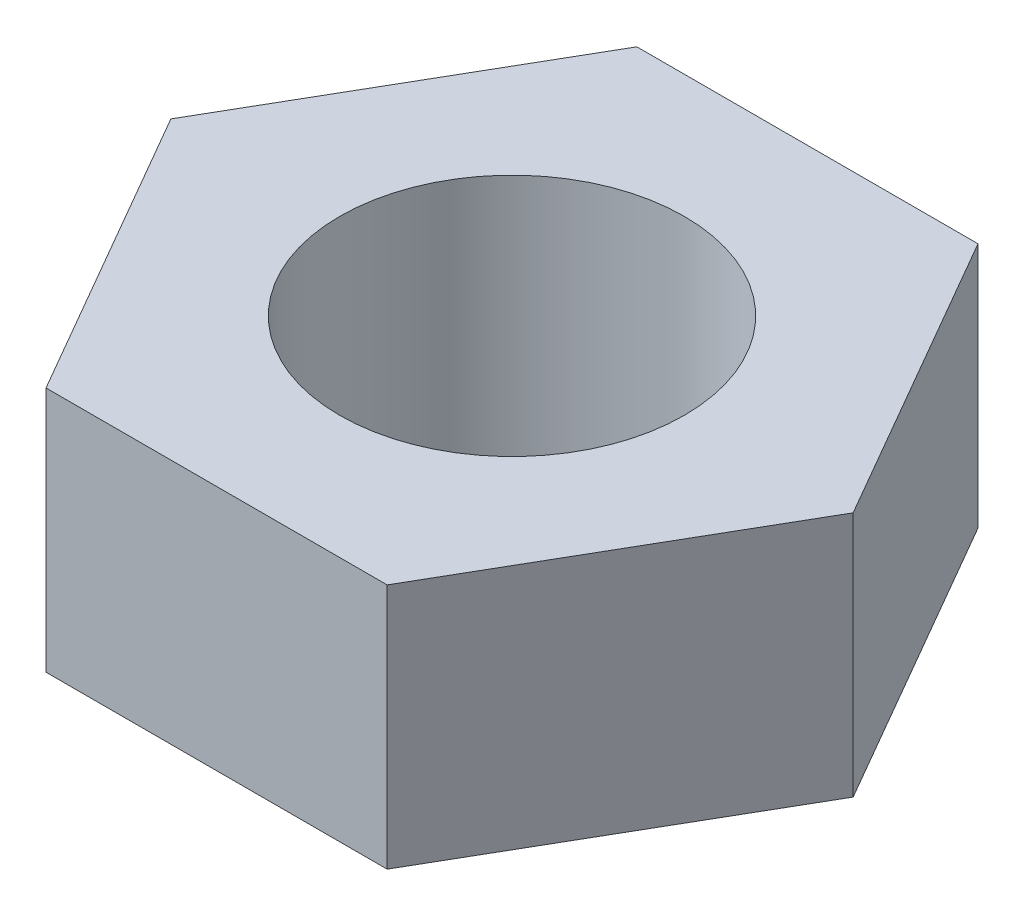
ISO-10303-21;
HEADER;
FILE_DESCRIPTION(('STEP AP214'),'2;1');
FILE_NAME('part.step','',(''),(''),'','','');
FILE_SCHEMA(('AUTOMOTIVE_DESIGN { 1 0 10303 214 1 1 1 1 }'));
ENDSEC;
DATA;
#1=APPLICATION_CONTEXT('core data for automotive mechanical design processes');
#2=APPLICATION_PROTOCOL_DEFINITION('international standard','automotive_design',2000,#1);
#3=PRODUCT_CONTEXT('',#1,'mechanical');
#4=PRODUCT('Part','Part','',(#3));
#5=PRODUCT_RELATED_PRODUCT_CATEGORY('part','',(#4));
#6=PRODUCT_DEFINITION_FORMATION('','',#4);
#7=PRODUCT_DEFINITION_CONTEXT('part definition',#1,'design');
#8=PRODUCT_DEFINITION('design','',#6,#7);
#9=PRODUCT_DEFINITION_SHAPE('','',#8);
#10=(LENGTH_UNIT() NAMED_UNIT(*) SI_UNIT(.MILLI.,.METRE.));
#11=(NAMED_UNIT(*) PLANE_ANGLE_UNIT() SI_UNIT($,.RADIAN.));
#12=(NAMED_UNIT(*) SI_UNIT($,.STERADIAN.) SOLID_ANGLE_UNIT());
#13=UNCERTAINTY_MEASURE_WITH_UNIT(LENGTH_MEASURE(1.E-05),#10,'distance_accuracy_value','');
#14=(GEOMETRIC_REPRESENTATION_CONTEXT(3) GLOBAL_UNCERTAINTY_ASSIGNED_CONTEXT((#13)) GLOBAL_UNIT_ASSIGNED_CONTEXT((#10,
#11,#12)) REPRESENTATION_CONTEXT('',''));
#15=CARTESIAN_POINT('',(0.,0.,0.));
#16=DIRECTION('',(0.,0.,1.));
#17=DIRECTION('',(1.,0.,0.));
#18=AXIS2_PLACEMENT_3D('',#15,#16,#17);
#19=CARTESIAN_POINT('',(0.,10.,0.));
#20=DIRECTION('',(0.,1.,0.));
#21=DIRECTION('',(0.,0.,1.));
#22=AXIS2_PLACEMENT_3D('',#19,#20,#21);
#23=PLANE('',#22);
#24=DIRECTION('',(0.5,0.,-0.866025403784439));
#25=VECTOR('',#24,1.);
#26=CARTESIAN_POINT('',(6.92820323027551,10.,12.));
#27=LINE('',#26,#25);
#28=CARTESIAN_POINT('',(6.92820323027551,10.,12.));
#29=VERTEX_POINT('',#28);
#30=CARTESIAN_POINT('',(13.856406460551,10.,0.));
#31=VERTEX_POINT('',#30);
#32=EDGE_CURVE('E150',#29,#31,#27,.T.);
#33=ORIENTED_EDGE('',*,*,#32,.T.);
#34=DIRECTION('',(-0.5,0.,-0.866025403784439));
#35=VECTOR('',#34,1.);
#36=CARTESIAN_POINT('',(13.856406460551,10.,0.));
#37=LINE('',#36,#35);
#38=CARTESIAN_POINT('',(6.9282032302755,10.,-12.));
#39=VERTEX_POINT('',#38);
#40=EDGE_CURVE('E98',#31,#39,#37,.T.);
#41=ORIENTED_EDGE('',*,*,#40,.T.);
#42=DIRECTION('',(-1.,0.,0.));
#43=VECTOR('',#42,1.);
#44=CARTESIAN_POINT('',(6.9282032302755,10.,-12.));
#45=LINE('',#44,#43);
#46=CARTESIAN_POINT('',(-6.92820323027551,10.,-12.));
#47=VERTEX_POINT('',#46);
#48=EDGE_CURVE('E111',#39,#47,#45,.T.);
#49=ORIENTED_EDGE('',*,*,#48,.T.);
#50=DIRECTION('',(-0.5,0.,0.866025403784439));
#51=VECTOR('',#50,1.);
#52=CARTESIAN_POINT('',(-6.92820323027551,10.,-12.));
#53=LINE('',#52,#51);
#54=CARTESIAN_POINT('',(-13.856406460551,10.,0.));
#55=VERTEX_POINT('',#54);
#56=EDGE_CURVE('E105',#47,#55,#53,.T.);
#57=ORIENTED_EDGE('',*,*,#56,.T.);
#58=DIRECTION('',(0.5,0.,0.866025403784439));
#59=VECTOR('',#58,1.);
#60=CARTESIAN_POINT('',(-13.856406460551,10.,0.));
#61=LINE('',#60,#59);
#62=CARTESIAN_POINT('',(-6.92820323027551,10.,12.));
#63=VERTEX_POINT('',#62);
#64=EDGE_CURVE('E109',#55,#63,#61,.T.);
#65=ORIENTED_EDGE('',*,*,#64,.T.);
#66=DIRECTION('',(1.,0.,0.));
#67=VECTOR('',#66,1.);
#68=CARTESIAN_POINT('',(-6.92820323027551,10.,12.));
#69=LINE('',#68,#67);
#70=EDGE_CURVE('E61',#63,#29,#69,.T.);
#71=ORIENTED_EDGE('',*,*,#70,.T.);
#72=EDGE_LOOP('',(#33,#41,#49,#57,#65,#71));
#73=FACE_BOUND('',#72,.T.);
#74=CARTESIAN_POINT('',(0.,10.,0.));
#75=DIRECTION('',(0.,1.,0.));
#76=DIRECTION('',(0.,0.,1.));
#77=AXIS2_PLACEMENT_3D('',#74,#75,#76);
#78=CIRCLE('',#77,7.);
#79=CARTESIAN_POINT('',(0.,10.,7.));
#80=VERTEX_POINT('',#79);
#81=EDGE_CURVE('E138',#80,#80,#78,.T.);
#82=ORIENTED_EDGE('',*,*,#81,.F.);
#83=EDGE_LOOP('',(#82));
#84=FACE_BOUND('',#83,.T.);
#85=ADVANCED_FACE('F43',(#73,#84),#23,.T.);
#86=CARTESIAN_POINT('',(0.,0.,0.));
#87=DIRECTION('',(0.,1.,0.));
#88=DIRECTION('',(0.,0.,1.));
#89=AXIS2_PLACEMENT_3D('',#86,#87,#88);
#90=PLANE('',#89);
#91=DIRECTION('',(0.5,0.,-0.866025403784439));
#92=VECTOR('',#91,1.);
#93=CARTESIAN_POINT('',(6.92820323027551,0.,12.));
#94=LINE('',#93,#92);
#95=CARTESIAN_POINT('',(6.92820323027551,0.,12.));
#96=VERTEX_POINT('',#95);
#97=CARTESIAN_POINT('',(13.856406460551,0.,0.));
#98=VERTEX_POINT('',#97);
#99=EDGE_CURVE('E133',#96,#98,#94,.T.);
#100=ORIENTED_EDGE('',*,*,#99,.F.);
#101=DIRECTION('',(1.,0.,0.));
#102=VECTOR('',#101,1.);
#103=CARTESIAN_POINT('',(-6.92820323027551,0.,12.));
#104=LINE('',#103,#102);
#105=CARTESIAN_POINT('',(-6.92820323027551,0.,12.));
#106=VERTEX_POINT('',#105);
#107=EDGE_CURVE('E90',#106,#96,#104,.T.);
#108=ORIENTED_EDGE('',*,*,#107,.F.);
#109=DIRECTION('',(0.5,0.,0.866025403784439));
#110=VECTOR('',#109,1.);
#111=CARTESIAN_POINT('',(-13.856406460551,0.,0.));
#112=LINE('',#111,#110);
#113=CARTESIAN_POINT('',(-13.856406460551,0.,0.));
#114=VERTEX_POINT('',#113);
#115=EDGE_CURVE('E84',#114,#106,#112,.T.);
#116=ORIENTED_EDGE('',*,*,#115,.F.);
#117=DIRECTION('',(-0.5,0.,0.866025403784439));
#118=VECTOR('',#117,1.);
#119=CARTESIAN_POINT('',(-6.92820323027551,0.,-12.));
#120=LINE('',#119,#118);
#121=CARTESIAN_POINT('',(-6.92820323027551,0.,-12.));
#122=VERTEX_POINT('',#121);
#123=EDGE_CURVE('E120',#122,#114,#120,.T.);
#124=ORIENTED_EDGE('',*,*,#123,.F.);
#125=DIRECTION('',(-1.,0.,0.));
#126=VECTOR('',#125,1.);
#127=CARTESIAN_POINT('',(6.9282032302755,0.,-12.));
#128=LINE('',#127,#126);
#129=CARTESIAN_POINT('',(6.9282032302755,0.,-12.));
#130=VERTEX_POINT('',#129);
#131=EDGE_CURVE('E141',#130,#122,#128,.T.);
#132=ORIENTED_EDGE('',*,*,#131,.F.);
#133=DIRECTION('',(-0.5,0.,-0.866025403784439));
#134=VECTOR('',#133,1.);
#135=CARTESIAN_POINT('',(13.856406460551,0.,0.));
#136=LINE('',#135,#134);
#137=EDGE_CURVE('E137',#98,#130,#136,.T.);
#138=ORIENTED_EDGE('',*,*,#137,.F.);
#139=EDGE_LOOP('',(#100,#108,#116,#124,#132,#138));
#140=FACE_BOUND('',#139,.T.);
#141=CARTESIAN_POINT('',(0.,0.,0.));
#142=DIRECTION('',(0.,1.,0.));
#143=DIRECTION('',(0.,0.,1.));
#144=AXIS2_PLACEMENT_3D('',#141,#142,#143);
#145=CIRCLE('',#144,7.);
#146=CARTESIAN_POINT('',(0.,0.,7.));
#147=VERTEX_POINT('',#146);
#148=EDGE_CURVE('E265',#147,#147,#145,.T.);
#149=ORIENTED_EDGE('',*,*,#148,.T.);
#150=EDGE_LOOP('',(#149));
#151=FACE_BOUND('',#150,.T.);
#152=ADVANCED_FACE('F163',(#140,#151),#90,.F.);
#153=CARTESIAN_POINT('',(6.92820323027551,10.,12.));
#154=DIRECTION('',(-0.866025403784439,0.,-0.5));
#155=DIRECTION('',(-0.5,0.,0.866025403784439));
#156=AXIS2_PLACEMENT_3D('',#153,#154,#155);
#157=PLANE('',#156);
#158=ORIENTED_EDGE('',*,*,#99,.T.);
#159=DIRECTION('',(0.,-1.,0.));
#160=VECTOR('',#159,1.);
#161=CARTESIAN_POINT('',(13.856406460551,10.,0.));
#162=LINE('',#161,#160);
#163=EDGE_CURVE('E11',#31,#98,#162,.T.);
#164=ORIENTED_EDGE('',*,*,#163,.F.);
#165=ORIENTED_EDGE('',*,*,#32,.F.);
#166=DIRECTION('',(0.,-1.,0.));
#167=VECTOR('',#166,1.);
#168=CARTESIAN_POINT('',(6.92820323027551,10.,12.));
#169=LINE('',#168,#167);
#170=EDGE_CURVE('E129',#29,#96,#169,.T.);
#171=ORIENTED_EDGE('',*,*,#170,.T.);
#172=EDGE_LOOP('',(#158,#164,#165,#171));
#173=FACE_BOUND('',#172,.T.);
#174=ADVANCED_FACE('F45',(#173),#157,.F.);
#175=CARTESIAN_POINT('',(13.856406460551,10.,0.));
#176=DIRECTION('',(-0.866025403784439,0.,0.5));
#177=DIRECTION('',(0.5,0.,0.866025403784439));
#178=AXIS2_PLACEMENT_3D('',#175,#176,#177);
#179=PLANE('',#178);
#180=ORIENTED_EDGE('',*,*,#137,.T.);
#181=DIRECTION('',(0.,-1.,0.));
#182=VECTOR('',#181,1.);
#183=CARTESIAN_POINT('',(6.9282032302755,10.,-12.));
#184=LINE('',#183,#182);
#185=EDGE_CURVE('E53',#39,#130,#184,.T.);
#186=ORIENTED_EDGE('',*,*,#185,.F.);
#187=ORIENTED_EDGE('',*,*,#40,.F.);
#188=ORIENTED_EDGE('',*,*,#163,.T.);
#189=EDGE_LOOP('',(#180,#186,#187,#188));
#190=FACE_BOUND('',#189,.T.);
#191=ADVANCED_FACE('F188',(#190),#179,.F.);
#192=CARTESIAN_POINT('',(6.9282032302755,10.,-12.));
#193=DIRECTION('',(0.,0.,1.));
#194=DIRECTION('',(1.,0.,0.));
#195=AXIS2_PLACEMENT_3D('',#192,#193,#194);
#196=PLANE('',#195);
#197=ORIENTED_EDGE('',*,*,#131,.T.);
#198=DIRECTION('',(0.,-1.,0.));
#199=VECTOR('',#198,1.);
#200=CARTESIAN_POINT('',(-6.92820323027551,10.,-12.));
#201=LINE('',#200,#199);
#202=EDGE_CURVE('E122',#47,#122,#201,.T.);
#203=ORIENTED_EDGE('',*,*,#202,.F.);
#204=ORIENTED_EDGE('',*,*,#48,.F.);
#205=ORIENTED_EDGE('',*,*,#185,.T.);
#206=EDGE_LOOP('',(#197,#203,#204,#205));
#207=FACE_BOUND('',#206,.T.);
#208=ADVANCED_FACE('F160',(#207),#196,.F.);
#209=CARTESIAN_POINT('',(-6.92820323027551,10.,-12.));
#210=DIRECTION('',(0.866025403784439,0.,0.5));
#211=DIRECTION('',(0.5,0.,-0.866025403784439));
#212=AXIS2_PLACEMENT_3D('',#209,#210,#211);
#213=PLANE('',#212);
#214=ORIENTED_EDGE('',*,*,#123,.T.);
#215=DIRECTION('',(0.,-1.,0.));
#216=VECTOR('',#215,1.);
#217=CARTESIAN_POINT('',(-13.856406460551,10.,0.));
#218=LINE('',#217,#216);
#219=EDGE_CURVE('E117',#55,#114,#218,.T.);
#220=ORIENTED_EDGE('',*,*,#219,.F.);
#221=ORIENTED_EDGE('',*,*,#56,.F.);
#222=ORIENTED_EDGE('',*,*,#202,.T.);
#223=EDGE_LOOP('',(#214,#220,#221,#222));
#224=FACE_BOUND('',#223,.T.);
#225=ADVANCED_FACE('F118',(#224),#213,.F.);
#226=CARTESIAN_POINT('',(-13.856406460551,10.,0.));
#227=DIRECTION('',(0.866025403784439,0.,-0.5));
#228=DIRECTION('',(-0.5,0.,-0.866025403784439));
#229=AXIS2_PLACEMENT_3D('',#226,#227,#228);
#230=PLANE('',#229);
#231=ORIENTED_EDGE('',*,*,#115,.T.);
#232=DIRECTION('',(0.,-1.,0.));
#233=VECTOR('',#232,1.);
#234=CARTESIAN_POINT('',(-6.92820323027551,10.,12.));
#235=LINE('',#234,#233);
#236=EDGE_CURVE('E123',#63,#106,#235,.T.);
#237=ORIENTED_EDGE('',*,*,#236,.F.);
#238=ORIENTED_EDGE('',*,*,#64,.F.);
#239=ORIENTED_EDGE('',*,*,#219,.T.);
#240=EDGE_LOOP('',(#231,#237,#238,#239));
#241=FACE_BOUND('',#240,.T.);
#242=ADVANCED_FACE('F125',(#241),#230,.F.);
#243=CARTESIAN_POINT('',(-6.92820323027551,10.,12.));
#244=DIRECTION('',(0.,0.,-1.));
#245=DIRECTION('',(-1.,0.,0.));
#246=AXIS2_PLACEMENT_3D('',#243,#244,#245);
#247=PLANE('',#246);
#248=ORIENTED_EDGE('',*,*,#107,.T.);
#249=ORIENTED_EDGE('',*,*,#170,.F.);
#250=ORIENTED_EDGE('',*,*,#70,.F.);
#251=ORIENTED_EDGE('',*,*,#236,.T.);
#252=EDGE_LOOP('',(#248,#249,#250,#251));
#253=FACE_BOUND('',#252,.T.);
#254=ADVANCED_FACE('F168',(#253),#247,.F.);
#255=CARTESIAN_POINT('',(0.,10.,0.));
#256=DIRECTION('',(0.,-1.,0.));
#257=DIRECTION('',(0.,0.,-1.));
#258=AXIS2_PLACEMENT_3D('',#255,#256,#257);
#259=CYLINDRICAL_SURFACE('',#258,7.);
#260=ORIENTED_EDGE('',*,*,#81,.T.);
#261=EDGE_LOOP('',(#260));
#262=FACE_BOUND('',#261,.T.);
#263=ORIENTED_EDGE('',*,*,#148,.F.);
#264=EDGE_LOOP('',(#263));
#265=FACE_BOUND('',#264,.T.);
#266=ADVANCED_FACE('F170',(#262,#265),#259,.F.);
#267=CLOSED_SHELL('',(#85,#152,#174,#191,#208,#225,#242,#254,#266));
#268=MANIFOLD_SOLID_BREP('B2',#267);
#269=ADVANCED_BREP_SHAPE_REPRESENTATION('',(#18,#268),#14);
#270=SHAPE_DEFINITION_REPRESENTATION(#9,#269);
ENDSEC;
END-ISO-10303-21;
